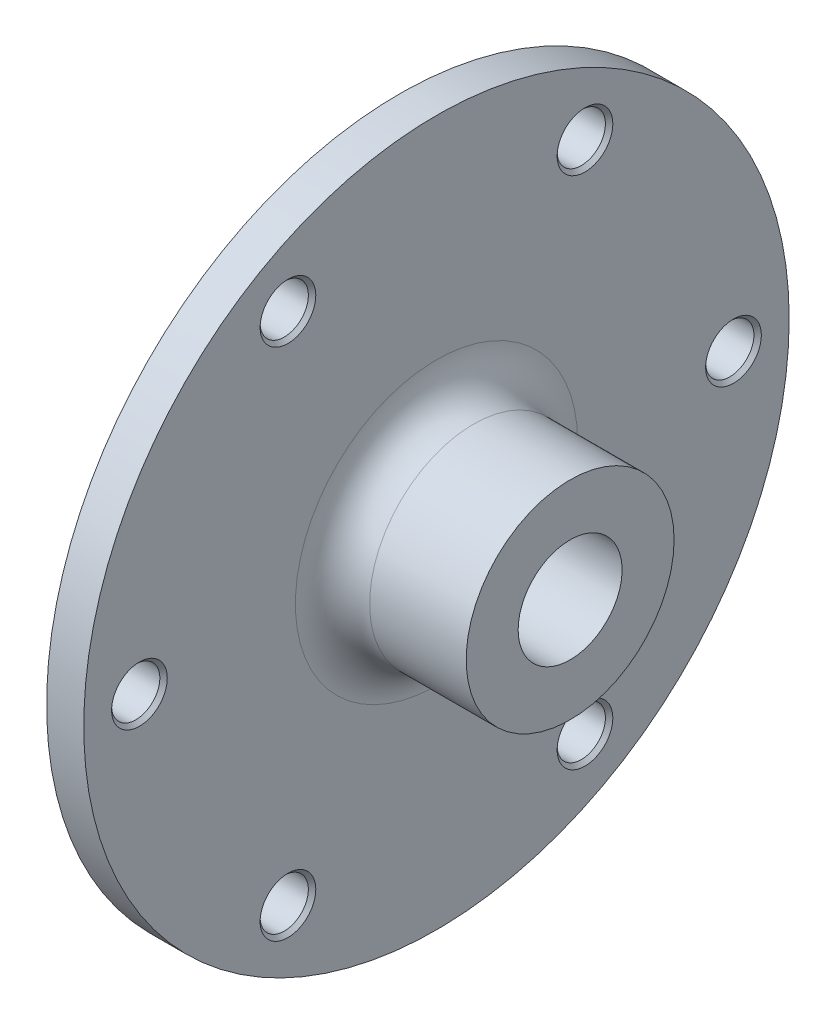
ISO-10303-21;
HEADER;
FILE_DESCRIPTION(('STEP AP214'),'2;1');
FILE_NAME('part.step','',(''),(''),'','','');
FILE_SCHEMA(('AUTOMOTIVE_DESIGN { 1 0 10303 214 1 1 1 1 }'));
ENDSEC;
DATA;
#1=APPLICATION_CONTEXT('core data for automotive mechanical design processes');
#2=APPLICATION_PROTOCOL_DEFINITION('international standard','automotive_design',2000,#1);
#3=PRODUCT_CONTEXT('',#1,'mechanical');
#4=PRODUCT('Part','Part','',(#3));
#5=PRODUCT_RELATED_PRODUCT_CATEGORY('part','',(#4));
#6=PRODUCT_DEFINITION_FORMATION('','',#4);
#7=PRODUCT_DEFINITION_CONTEXT('part definition',#1,'design');
#8=PRODUCT_DEFINITION('design','',#6,#7);
#9=PRODUCT_DEFINITION_SHAPE('','',#8);
#10=(LENGTH_UNIT() NAMED_UNIT(*) SI_UNIT(.MILLI.,.METRE.));
#11=(NAMED_UNIT(*) PLANE_ANGLE_UNIT() SI_UNIT($,.RADIAN.));
#12=(NAMED_UNIT(*) SI_UNIT($,.STERADIAN.) SOLID_ANGLE_UNIT());
#13=UNCERTAINTY_MEASURE_WITH_UNIT(LENGTH_MEASURE(1.E-05),#10,'distance_accuracy_value','');
#14=(GEOMETRIC_REPRESENTATION_CONTEXT(3) GLOBAL_UNCERTAINTY_ASSIGNED_CONTEXT((#13)) GLOBAL_UNIT_ASSIGNED_CONTEXT((#10,
#11,#12)) REPRESENTATION_CONTEXT('',''));
#15=CARTESIAN_POINT('',(0.,0.,0.));
#16=DIRECTION('',(0.,0.,1.));
#17=DIRECTION('',(1.,0.,0.));
#18=AXIS2_PLACEMENT_3D('',#15,#16,#17);
#19=CARTESIAN_POINT('',(0.,14.,0.));
#20=DIRECTION('',(1.,0.,0.));
#21=DIRECTION('',(0.,0.,-1.));
#22=AXIS2_PLACEMENT_3D('',#19,#20,#21);
#23=PLANE('',#22);
#24=CARTESIAN_POINT('',(0.,0.,0.));
#25=DIRECTION('',(-1.,0.,0.));
#26=DIRECTION('',(0.,0.,1.));
#27=AXIS2_PLACEMENT_3D('',#24,#25,#26);
#28=CIRCLE('',#27,6.99999999999999);
#29=CARTESIAN_POINT('',(0.,0.,6.99999999999999));
#30=VERTEX_POINT('',#29);
#31=EDGE_CURVE('E128',#30,#30,#28,.T.);
#32=ORIENTED_EDGE('',*,*,#31,.T.);
#33=EDGE_LOOP('',(#32));
#34=FACE_BOUND('',#33,.T.);
#35=CARTESIAN_POINT('',(0.,0.,0.));
#36=DIRECTION('',(1.,0.,0.));
#37=DIRECTION('',(0.,0.,-1.));
#38=AXIS2_PLACEMENT_3D('',#35,#36,#37);
#39=CIRCLE('',#38,14.);
#40=CARTESIAN_POINT('',(0.,0.,-14.));
#41=VERTEX_POINT('',#40);
#42=EDGE_CURVE('E132',#41,#41,#39,.T.);
#43=ORIENTED_EDGE('',*,*,#42,.T.);
#44=EDGE_LOOP('',(#43));
#45=FACE_BOUND('',#44,.T.);
#46=ADVANCED_FACE('F37',(#34,#45),#23,.T.);
#47=CARTESIAN_POINT('',(-28.,0.,0.));
#48=DIRECTION('',(-1.,0.,0.));
#49=DIRECTION('',(0.,0.,1.));
#50=AXIS2_PLACEMENT_3D('',#47,#48,#49);
#51=PLANE('',#50);
#52=CARTESIAN_POINT('',(-28.,0.,0.));
#53=DIRECTION('',(-1.,0.,0.));
#54=DIRECTION('',(0.,0.,1.));
#55=AXIS2_PLACEMENT_3D('',#52,#53,#54);
#56=CIRCLE('',#55,13.);
#57=CARTESIAN_POINT('',(-28.,0.,13.));
#58=VERTEX_POINT('',#57);
#59=EDGE_CURVE('E60',#58,#58,#56,.T.);
#60=ORIENTED_EDGE('',*,*,#59,.F.);
#61=EDGE_LOOP('',(#60));
#62=FACE_BOUND('',#61,.T.);
#63=CARTESIAN_POINT('',(-28.,0.,0.));
#64=DIRECTION('',(1.,0.,0.));
#65=DIRECTION('',(0.,0.,-1.));
#66=AXIS2_PLACEMENT_3D('',#63,#64,#65);
#67=CIRCLE('',#66,35.);
#68=CARTESIAN_POINT('',(-28.,0.,-35.));
#69=VERTEX_POINT('',#68);
#70=EDGE_CURVE('E52',#69,#69,#67,.T.);
#71=ORIENTED_EDGE('',*,*,#70,.F.);
#72=EDGE_LOOP('',(#71));
#73=FACE_BOUND('',#72,.T.);
#74=ADVANCED_FACE('F154',(#62,#73),#51,.T.);
#75=CARTESIAN_POINT('',(0.,0.,0.));
#76=DIRECTION('',(1.,0.,0.));
#77=DIRECTION('',(0.,0.,-1.));
#78=AXIS2_PLACEMENT_3D('',#75,#76,#77);
#79=CYLINDRICAL_SURFACE('',#78,35.);
#80=ORIENTED_EDGE('',*,*,#70,.T.);
#81=EDGE_LOOP('',(#80));
#82=FACE_BOUND('',#81,.T.);
#83=CARTESIAN_POINT('',(-23.,0.,0.));
#84=DIRECTION('',(1.,0.,0.));
#85=DIRECTION('',(0.,0.,-1.));
#86=AXIS2_PLACEMENT_3D('',#83,#84,#85);
#87=CIRCLE('',#86,35.);
#88=CARTESIAN_POINT('',(-23.,0.,-35.));
#89=VERTEX_POINT('',#88);
#90=EDGE_CURVE('E144',#89,#89,#87,.T.);
#91=ORIENTED_EDGE('',*,*,#90,.F.);
#92=EDGE_LOOP('',(#91));
#93=FACE_BOUND('',#92,.T.);
#94=ADVANCED_FACE('F151',(#82,#93),#79,.T.);
#95=CARTESIAN_POINT('',(-23.,35.,0.));
#96=DIRECTION('',(-1.,0.,0.));
#97=DIRECTION('',(0.,0.,1.));
#98=AXIS2_PLACEMENT_3D('',#95,#96,#97);
#99=PLANE('',#98);
#100=CARTESIAN_POINT('',(-23.,34.6410161513773,20.0000000000004));
#101=DIRECTION('',(-1.,0.,0.));
#102=DIRECTION('',(0.,0.,1.));
#103=AXIS2_PLACEMENT_3D('',#100,#101,#102);
#104=CIRCLE('',#103,3.25);
#105=CARTESIAN_POINT('',(-23.,34.6410161513773,23.2500000000004));
#106=VERTEX_POINT('',#105);
#107=EDGE_CURVE('E41',#106,#106,#104,.T.);
#108=ORIENTED_EDGE('',*,*,#107,.F.);
#109=EDGE_LOOP('',(#108));
#110=FACE_BOUND('',#109,.T.);
#111=CARTESIAN_POINT('',(-23.,34.6410161513777,-19.9999999999997));
#112=DIRECTION('',(-1.,0.,0.));
#113=DIRECTION('',(0.,0.,1.));
#114=AXIS2_PLACEMENT_3D('',#111,#112,#113);
#115=CIRCLE('',#114,3.25);
#116=CARTESIAN_POINT('',(-23.,34.6410161513777,-16.7499999999997));
#117=VERTEX_POINT('',#116);
#118=EDGE_CURVE('E79',#117,#117,#115,.T.);
#119=ORIENTED_EDGE('',*,*,#118,.F.);
#120=EDGE_LOOP('',(#119));
#121=FACE_BOUND('',#120,.T.);
#122=CARTESIAN_POINT('',(-23.,0.,-40.));
#123=DIRECTION('',(-1.,0.,0.));
#124=DIRECTION('',(0.,0.,1.));
#125=AXIS2_PLACEMENT_3D('',#122,#123,#124);
#126=CIRCLE('',#125,3.25);
#127=CARTESIAN_POINT('',(-23.,0.,-36.75));
#128=VERTEX_POINT('',#127);
#129=EDGE_CURVE('E74',#128,#128,#126,.T.);
#130=ORIENTED_EDGE('',*,*,#129,.F.);
#131=EDGE_LOOP('',(#130));
#132=FACE_BOUND('',#131,.T.);
#133=CARTESIAN_POINT('',(-23.,-34.6410161513775,-20.0000000000002));
#134=DIRECTION('',(-1.,0.,0.));
#135=DIRECTION('',(0.,0.,1.));
#136=AXIS2_PLACEMENT_3D('',#133,#134,#135);
#137=CIRCLE('',#136,3.25);
#138=CARTESIAN_POINT('',(-23.,-34.6410161513775,-16.7500000000002));
#139=VERTEX_POINT('',#138);
#140=EDGE_CURVE('E68',#139,#139,#137,.T.);
#141=ORIENTED_EDGE('',*,*,#140,.F.);
#142=EDGE_LOOP('',(#141));
#143=FACE_BOUND('',#142,.T.);
#144=CARTESIAN_POINT('',(-23.,-34.6410161513776,19.9999999999999));
#145=DIRECTION('',(-1.,0.,0.));
#146=DIRECTION('',(0.,0.,1.));
#147=AXIS2_PLACEMENT_3D('',#144,#145,#146);
#148=CIRCLE('',#147,3.25);
#149=CARTESIAN_POINT('',(-23.,-34.6410161513776,23.2499999999999));
#150=VERTEX_POINT('',#149);
#151=EDGE_CURVE('E62',#150,#150,#148,.T.);
#152=ORIENTED_EDGE('',*,*,#151,.F.);
#153=EDGE_LOOP('',(#152));
#154=FACE_BOUND('',#153,.T.);
#155=CARTESIAN_POINT('',(-23.,0.,40.));
#156=DIRECTION('',(-1.,0.,0.));
#157=DIRECTION('',(0.,0.,1.));
#158=AXIS2_PLACEMENT_3D('',#155,#156,#157);
#159=CIRCLE('',#158,3.25);
#160=CARTESIAN_POINT('',(-23.,0.,43.25));
#161=VERTEX_POINT('',#160);
#162=EDGE_CURVE('E56',#161,#161,#159,.T.);
#163=ORIENTED_EDGE('',*,*,#162,.F.);
#164=EDGE_LOOP('',(#163));
#165=FACE_BOUND('',#164,.T.);
#166=ORIENTED_EDGE('',*,*,#90,.T.);
#167=EDGE_LOOP('',(#166));
#168=FACE_BOUND('',#167,.T.);
#169=CARTESIAN_POINT('',(-23.,0.,0.));
#170=DIRECTION('',(1.,0.,0.));
#171=DIRECTION('',(0.,0.,-1.));
#172=AXIS2_PLACEMENT_3D('',#169,#170,#171);
#173=CIRCLE('',#172,47.5);
#174=CARTESIAN_POINT('',(-23.,0.,-47.5));
#175=VERTEX_POINT('',#174);
#176=EDGE_CURVE('E140',#175,#175,#173,.T.);
#177=ORIENTED_EDGE('',*,*,#176,.F.);
#178=EDGE_LOOP('',(#177));
#179=FACE_BOUND('',#178,.T.);
#180=ADVANCED_FACE('F162',(#110,#121,#132,#143,#154,#165,#168,#179),#99,.T.);
#181=CARTESIAN_POINT('',(0.,0.,0.));
#182=DIRECTION('',(1.,0.,0.));
#183=DIRECTION('',(0.,0.,-1.));
#184=AXIS2_PLACEMENT_3D('',#181,#182,#183);
#185=CYLINDRICAL_SURFACE('',#184,47.5);
#186=ORIENTED_EDGE('',*,*,#176,.T.);
#187=EDGE_LOOP('',(#186));
#188=FACE_BOUND('',#187,.T.);
#189=CARTESIAN_POINT('',(-18.,0.,0.));
#190=DIRECTION('',(1.,0.,0.));
#191=DIRECTION('',(0.,0.,-1.));
#192=AXIS2_PLACEMENT_3D('',#189,#190,#191);
#193=CIRCLE('',#192,47.5);
#194=CARTESIAN_POINT('',(-18.,0.,-47.5));
#195=VERTEX_POINT('',#194);
#196=EDGE_CURVE('E136',#195,#195,#193,.T.);
#197=ORIENTED_EDGE('',*,*,#196,.F.);
#198=EDGE_LOOP('',(#197));
#199=FACE_BOUND('',#198,.T.);
#200=ADVANCED_FACE('F169',(#188,#199),#185,.T.);
#201=CARTESIAN_POINT('',(-18.,47.5,0.));
#202=DIRECTION('',(1.,0.,0.));
#203=DIRECTION('',(0.,0.,-1.));
#204=AXIS2_PLACEMENT_3D('',#201,#202,#203);
#205=PLANE('',#204);
#206=CARTESIAN_POINT('',(-18.,34.6410161513773,20.0000000000004));
#207=DIRECTION('',(1.,0.,0.));
#208=DIRECTION('',(0.,0.,-1.));
#209=AXIS2_PLACEMENT_3D('',#206,#207,#208);
#210=CIRCLE('',#209,3.75);
#211=CARTESIAN_POINT('',(-18.,34.6410161513773,16.2500000000004));
#212=VERTEX_POINT('',#211);
#213=EDGE_CURVE('E244',#212,#212,#210,.T.);
#214=ORIENTED_EDGE('',*,*,#213,.F.);
#215=EDGE_LOOP('',(#214));
#216=FACE_BOUND('',#215,.T.);
#217=CARTESIAN_POINT('',(-18.,34.6410161513777,-19.9999999999997));
#218=DIRECTION('',(1.,0.,0.));
#219=DIRECTION('',(0.,0.,-1.));
#220=AXIS2_PLACEMENT_3D('',#217,#218,#219);
#221=CIRCLE('',#220,3.75);
#222=CARTESIAN_POINT('',(-18.,34.6410161513777,-23.7499999999997));
#223=VERTEX_POINT('',#222);
#224=EDGE_CURVE('E91',#223,#223,#221,.T.);
#225=ORIENTED_EDGE('',*,*,#224,.F.);
#226=EDGE_LOOP('',(#225));
#227=FACE_BOUND('',#226,.T.);
#228=CARTESIAN_POINT('',(-18.,0.,-40.));
#229=DIRECTION('',(1.,0.,0.));
#230=DIRECTION('',(0.,0.,-1.));
#231=AXIS2_PLACEMENT_3D('',#228,#229,#230);
#232=CIRCLE('',#231,3.75);
#233=CARTESIAN_POINT('',(-18.,0.,-43.75));
#234=VERTEX_POINT('',#233);
#235=EDGE_CURVE('E82',#234,#234,#232,.T.);
#236=ORIENTED_EDGE('',*,*,#235,.F.);
#237=EDGE_LOOP('',(#236));
#238=FACE_BOUND('',#237,.T.);
#239=CARTESIAN_POINT('',(-18.,-34.6410161513775,-20.0000000000002));
#240=DIRECTION('',(1.,0.,0.));
#241=DIRECTION('',(0.,0.,-1.));
#242=AXIS2_PLACEMENT_3D('',#239,#240,#241);
#243=CIRCLE('',#242,3.75);
#244=CARTESIAN_POINT('',(-18.,-34.6410161513775,-23.7500000000002));
#245=VERTEX_POINT('',#244);
#246=EDGE_CURVE('E77',#245,#245,#243,.T.);
#247=ORIENTED_EDGE('',*,*,#246,.F.);
#248=EDGE_LOOP('',(#247));
#249=FACE_BOUND('',#248,.T.);
#250=CARTESIAN_POINT('',(-18.,-34.6410161513776,19.9999999999999));
#251=DIRECTION('',(1.,0.,0.));
#252=DIRECTION('',(0.,0.,-1.));
#253=AXIS2_PLACEMENT_3D('',#250,#251,#252);
#254=CIRCLE('',#253,3.75);
#255=CARTESIAN_POINT('',(-18.,-34.6410161513776,16.2499999999999));
#256=VERTEX_POINT('',#255);
#257=EDGE_CURVE('E72',#256,#256,#254,.T.);
#258=ORIENTED_EDGE('',*,*,#257,.F.);
#259=EDGE_LOOP('',(#258));
#260=FACE_BOUND('',#259,.T.);
#261=CARTESIAN_POINT('',(-18.,0.,40.));
#262=DIRECTION('',(1.,0.,0.));
#263=DIRECTION('',(0.,0.,-1.));
#264=AXIS2_PLACEMENT_3D('',#261,#262,#263);
#265=CIRCLE('',#264,3.75);
#266=CARTESIAN_POINT('',(-18.,0.,36.25));
#267=VERTEX_POINT('',#266);
#268=EDGE_CURVE('E66',#267,#267,#265,.T.);
#269=ORIENTED_EDGE('',*,*,#268,.F.);
#270=EDGE_LOOP('',(#269));
#271=FACE_BOUND('',#270,.T.);
#272=CARTESIAN_POINT('',(-18.,0.,0.));
#273=DIRECTION('',(1.,0.,0.));
#274=DIRECTION('',(0.,0.,-1.));
#275=AXIS2_PLACEMENT_3D('',#272,#273,#274);
#276=CIRCLE('',#275,19.);
#277=CARTESIAN_POINT('',(-18.,0.,-19.));
#278=VERTEX_POINT('',#277);
#279=EDGE_CURVE('E10',#278,#278,#276,.F.);
#280=ORIENTED_EDGE('',*,*,#279,.T.);
#281=EDGE_LOOP('',(#280));
#282=FACE_BOUND('',#281,.T.);
#283=ORIENTED_EDGE('',*,*,#196,.T.);
#284=EDGE_LOOP('',(#283));
#285=FACE_BOUND('',#284,.T.);
#286=ADVANCED_FACE('F173',(#216,#227,#238,#249,#260,#271,#282,#285),#205,.T.);
#287=CARTESIAN_POINT('',(0.,0.,0.));
#288=DIRECTION('',(1.,0.,0.));
#289=DIRECTION('',(0.,0.,-1.));
#290=AXIS2_PLACEMENT_3D('',#287,#288,#289);
#291=CYLINDRICAL_SURFACE('',#290,14.);
#292=CARTESIAN_POINT('',(-13.,0.,0.));
#293=DIRECTION('',(1.,0.,0.));
#294=DIRECTION('',(0.,0.,-1.));
#295=AXIS2_PLACEMENT_3D('',#292,#293,#294);
#296=CIRCLE('',#295,14.);
#297=CARTESIAN_POINT('',(-13.,0.,-14.));
#298=VERTEX_POINT('',#297);
#299=EDGE_CURVE('E46',#298,#298,#296,.T.);
#300=ORIENTED_EDGE('',*,*,#299,.T.);
#301=EDGE_LOOP('',(#300));
#302=FACE_BOUND('',#301,.T.);
#303=ORIENTED_EDGE('',*,*,#42,.F.);
#304=EDGE_LOOP('',(#303));
#305=FACE_BOUND('',#304,.T.);
#306=ADVANCED_FACE('F177',(#302,#305),#291,.T.);
#307=CARTESIAN_POINT('',(-13.,0.,0.));
#308=DIRECTION('',(1.,0.,0.));
#309=DIRECTION('',(0.,0.,-1.));
#310=AXIS2_PLACEMENT_3D('',#307,#308,#309);
#311=TOROIDAL_SURFACE('',#310,19.,5.);
#312=ORIENTED_EDGE('',*,*,#279,.F.);
#313=EDGE_LOOP('',(#312));
#314=FACE_BOUND('',#313,.T.);
#315=ORIENTED_EDGE('',*,*,#299,.F.);
#316=EDGE_LOOP('',(#315));
#317=FACE_BOUND('',#316,.T.);
#318=ADVANCED_FACE('F39',(#314,#317),#311,.F.);
#319=CARTESIAN_POINT('',(-28.,0.,0.));
#320=DIRECTION('',(-1.,0.,0.));
#321=DIRECTION('',(0.,0.,1.));
#322=AXIS2_PLACEMENT_3D('',#319,#320,#321);
#323=CYLINDRICAL_SURFACE('',#322,6.99999999999999);
#324=ORIENTED_EDGE('',*,*,#31,.F.);
#325=EDGE_LOOP('',(#324));
#326=FACE_BOUND('',#325,.T.);
#327=CARTESIAN_POINT('',(-22.,0.,0.));
#328=DIRECTION('',(-1.,0.,0.));
#329=DIRECTION('',(0.,0.,1.));
#330=AXIS2_PLACEMENT_3D('',#327,#328,#329);
#331=CIRCLE('',#330,7.);
#332=CARTESIAN_POINT('',(-22.,0.,7.));
#333=VERTEX_POINT('',#332);
#334=EDGE_CURVE('E124',#333,#333,#331,.T.);
#335=ORIENTED_EDGE('',*,*,#334,.T.);
#336=EDGE_LOOP('',(#335));
#337=FACE_BOUND('',#336,.T.);
#338=ADVANCED_FACE('F182',(#326,#337),#323,.F.);
#339=CARTESIAN_POINT('',(-28.,0.,0.));
#340=DIRECTION('',(-1.,0.,0.));
#341=DIRECTION('',(0.,0.,1.));
#342=AXIS2_PLACEMENT_3D('',#339,#340,#341);
#343=CONICAL_SURFACE('',#342,13.,0.785398163397449);
#344=ORIENTED_EDGE('',*,*,#334,.F.);
#345=EDGE_LOOP('',(#344));
#346=FACE_BOUND('',#345,.T.);
#347=ORIENTED_EDGE('',*,*,#59,.T.);
#348=EDGE_LOOP('',(#347));
#349=FACE_BOUND('',#348,.T.);
#350=ADVANCED_FACE('F185',(#346,#349),#343,.F.);
#351=CARTESIAN_POINT('',(-18.,0.,40.));
#352=DIRECTION('',(1.,0.,0.));
#353=DIRECTION('',(0.,0.,-1.));
#354=AXIS2_PLACEMENT_3D('',#351,#352,#353);
#355=CYLINDRICAL_SURFACE('',#354,3.25);
#356=ORIENTED_EDGE('',*,*,#162,.T.);
#357=EDGE_LOOP('',(#356));
#358=FACE_BOUND('',#357,.T.);
#359=CARTESIAN_POINT('',(-18.5,0.,40.));
#360=DIRECTION('',(1.,0.,0.));
#361=DIRECTION('',(0.,0.,-1.));
#362=AXIS2_PLACEMENT_3D('',#359,#360,#361);
#363=CIRCLE('',#362,3.25);
#364=CARTESIAN_POINT('',(-18.5,0.,36.75));
#365=VERTEX_POINT('',#364);
#366=EDGE_CURVE('E61',#365,#365,#363,.T.);
#367=ORIENTED_EDGE('',*,*,#366,.T.);
#368=EDGE_LOOP('',(#367));
#369=FACE_BOUND('',#368,.T.);
#370=ADVANCED_FACE('F189',(#358,#369),#355,.F.);
#371=CARTESIAN_POINT('',(-18.,0.,40.));
#372=DIRECTION('',(1.,0.,0.));
#373=DIRECTION('',(0.,0.,-1.));
#374=AXIS2_PLACEMENT_3D('',#371,#372,#373);
#375=CONICAL_SURFACE('',#374,3.75,0.785398163397447);
#376=ORIENTED_EDGE('',*,*,#366,.F.);
#377=EDGE_LOOP('',(#376));
#378=FACE_BOUND('',#377,.T.);
#379=ORIENTED_EDGE('',*,*,#268,.T.);
#380=EDGE_LOOP('',(#379));
#381=FACE_BOUND('',#380,.T.);
#382=ADVANCED_FACE('F193',(#378,#381),#375,.F.);
#383=CARTESIAN_POINT('',(-18.,-34.6410161513776,19.9999999999999));
#384=DIRECTION('',(1.,0.,0.));
#385=DIRECTION('',(0.,0.,-1.));
#386=AXIS2_PLACEMENT_3D('',#383,#384,#385);
#387=CYLINDRICAL_SURFACE('',#386,3.25);
#388=ORIENTED_EDGE('',*,*,#151,.T.);
#389=EDGE_LOOP('',(#388));
#390=FACE_BOUND('',#389,.T.);
#391=CARTESIAN_POINT('',(-18.5,-34.6410161513776,19.9999999999999));
#392=DIRECTION('',(1.,0.,0.));
#393=DIRECTION('',(0.,0.,-1.));
#394=AXIS2_PLACEMENT_3D('',#391,#392,#393);
#395=CIRCLE('',#394,3.25);
#396=CARTESIAN_POINT('',(-18.5,-34.6410161513776,16.7499999999999));
#397=VERTEX_POINT('',#396);
#398=EDGE_CURVE('E67',#397,#397,#395,.T.);
#399=ORIENTED_EDGE('',*,*,#398,.T.);
#400=EDGE_LOOP('',(#399));
#401=FACE_BOUND('',#400,.T.);
#402=ADVANCED_FACE('F197',(#390,#401),#387,.F.);
#403=CARTESIAN_POINT('',(-18.,-34.6410161513776,19.9999999999999));
#404=DIRECTION('',(1.,0.,0.));
#405=DIRECTION('',(0.,0.,-1.));
#406=AXIS2_PLACEMENT_3D('',#403,#404,#405);
#407=CONICAL_SURFACE('',#406,3.75,0.785398163397448);
#408=ORIENTED_EDGE('',*,*,#398,.F.);
#409=EDGE_LOOP('',(#408));
#410=FACE_BOUND('',#409,.T.);
#411=ORIENTED_EDGE('',*,*,#257,.T.);
#412=EDGE_LOOP('',(#411));
#413=FACE_BOUND('',#412,.T.);
#414=ADVANCED_FACE('F201',(#410,#413),#407,.F.);
#415=CARTESIAN_POINT('',(-18.,-34.6410161513775,-20.0000000000002));
#416=DIRECTION('',(1.,0.,0.));
#417=DIRECTION('',(0.,0.,-1.));
#418=AXIS2_PLACEMENT_3D('',#415,#416,#417);
#419=CYLINDRICAL_SURFACE('',#418,3.25);
#420=ORIENTED_EDGE('',*,*,#140,.T.);
#421=EDGE_LOOP('',(#420));
#422=FACE_BOUND('',#421,.T.);
#423=CARTESIAN_POINT('',(-18.5,-34.6410161513775,-20.0000000000002));
#424=DIRECTION('',(1.,0.,0.));
#425=DIRECTION('',(0.,0.,-1.));
#426=AXIS2_PLACEMENT_3D('',#423,#424,#425);
#427=CIRCLE('',#426,3.25);
#428=CARTESIAN_POINT('',(-18.5,-34.6410161513775,-23.2500000000002));
#429=VERTEX_POINT('',#428);
#430=EDGE_CURVE('E73',#429,#429,#427,.T.);
#431=ORIENTED_EDGE('',*,*,#430,.T.);
#432=EDGE_LOOP('',(#431));
#433=FACE_BOUND('',#432,.T.);
#434=ADVANCED_FACE('F205',(#422,#433),#419,.F.);
#435=CARTESIAN_POINT('',(-18.,-34.6410161513775,-20.0000000000002));
#436=DIRECTION('',(1.,0.,0.));
#437=DIRECTION('',(0.,0.,-1.));
#438=AXIS2_PLACEMENT_3D('',#435,#436,#437);
#439=CONICAL_SURFACE('',#438,3.75,0.785398163397448);
#440=ORIENTED_EDGE('',*,*,#430,.F.);
#441=EDGE_LOOP('',(#440));
#442=FACE_BOUND('',#441,.T.);
#443=ORIENTED_EDGE('',*,*,#246,.T.);
#444=EDGE_LOOP('',(#443));
#445=FACE_BOUND('',#444,.T.);
#446=ADVANCED_FACE('F209',(#442,#445),#439,.F.);
#447=CARTESIAN_POINT('',(-18.,0.,-40.));
#448=DIRECTION('',(1.,0.,0.));
#449=DIRECTION('',(0.,0.,-1.));
#450=AXIS2_PLACEMENT_3D('',#447,#448,#449);
#451=CYLINDRICAL_SURFACE('',#450,3.25);
#452=ORIENTED_EDGE('',*,*,#129,.T.);
#453=EDGE_LOOP('',(#452));
#454=FACE_BOUND('',#453,.T.);
#455=CARTESIAN_POINT('',(-18.5,0.,-40.));
#456=DIRECTION('',(1.,0.,0.));
#457=DIRECTION('',(0.,0.,-1.));
#458=AXIS2_PLACEMENT_3D('',#455,#456,#457);
#459=CIRCLE('',#458,3.25);
#460=CARTESIAN_POINT('',(-18.5,0.,-43.25));
#461=VERTEX_POINT('',#460);
#462=EDGE_CURVE('E78',#461,#461,#459,.T.);
#463=ORIENTED_EDGE('',*,*,#462,.T.);
#464=EDGE_LOOP('',(#463));
#465=FACE_BOUND('',#464,.T.);
#466=ADVANCED_FACE('F213',(#454,#465),#451,.F.);
#467=CARTESIAN_POINT('',(-18.,0.,-40.));
#468=DIRECTION('',(1.,0.,0.));
#469=DIRECTION('',(0.,0.,-1.));
#470=AXIS2_PLACEMENT_3D('',#467,#468,#469);
#471=CONICAL_SURFACE('',#470,3.75,0.785398163397447);
#472=ORIENTED_EDGE('',*,*,#462,.F.);
#473=EDGE_LOOP('',(#472));
#474=FACE_BOUND('',#473,.T.);
#475=ORIENTED_EDGE('',*,*,#235,.T.);
#476=EDGE_LOOP('',(#475));
#477=FACE_BOUND('',#476,.T.);
#478=ADVANCED_FACE('F217',(#474,#477),#471,.F.);
#479=CARTESIAN_POINT('',(-18.,34.6410161513777,-19.9999999999997));
#480=DIRECTION('',(1.,0.,0.));
#481=DIRECTION('',(0.,0.,-1.));
#482=AXIS2_PLACEMENT_3D('',#479,#480,#481);
#483=CYLINDRICAL_SURFACE('',#482,3.25);
#484=ORIENTED_EDGE('',*,*,#118,.T.);
#485=EDGE_LOOP('',(#484));
#486=FACE_BOUND('',#485,.T.);
#487=CARTESIAN_POINT('',(-18.5,34.6410161513777,-19.9999999999997));
#488=DIRECTION('',(1.,0.,0.));
#489=DIRECTION('',(0.,0.,-1.));
#490=AXIS2_PLACEMENT_3D('',#487,#488,#489);
#491=CIRCLE('',#490,3.25);
#492=CARTESIAN_POINT('',(-18.5,34.6410161513777,-23.2499999999997));
#493=VERTEX_POINT('',#492);
#494=EDGE_CURVE('E83',#493,#493,#491,.T.);
#495=ORIENTED_EDGE('',*,*,#494,.T.);
#496=EDGE_LOOP('',(#495));
#497=FACE_BOUND('',#496,.T.);
#498=ADVANCED_FACE('F221',(#486,#497),#483,.F.);
#499=CARTESIAN_POINT('',(-18.,34.6410161513777,-19.9999999999997));
#500=DIRECTION('',(1.,0.,0.));
#501=DIRECTION('',(0.,0.,-1.));
#502=AXIS2_PLACEMENT_3D('',#499,#500,#501);
#503=CONICAL_SURFACE('',#502,3.75,0.785398163397445);
#504=ORIENTED_EDGE('',*,*,#494,.F.);
#505=EDGE_LOOP('',(#504));
#506=FACE_BOUND('',#505,.T.);
#507=ORIENTED_EDGE('',*,*,#224,.T.);
#508=EDGE_LOOP('',(#507));
#509=FACE_BOUND('',#508,.T.);
#510=ADVANCED_FACE('F225',(#506,#509),#503,.F.);
#511=CARTESIAN_POINT('',(-18.,34.6410161513773,20.0000000000004));
#512=DIRECTION('',(1.,0.,0.));
#513=DIRECTION('',(0.,0.,-1.));
#514=AXIS2_PLACEMENT_3D('',#511,#512,#513);
#515=CYLINDRICAL_SURFACE('',#514,3.25);
#516=ORIENTED_EDGE('',*,*,#107,.T.);
#517=EDGE_LOOP('',(#516));
#518=FACE_BOUND('',#517,.T.);
#519=CARTESIAN_POINT('',(-18.5,34.6410161513773,20.0000000000004));
#520=DIRECTION('',(1.,0.,0.));
#521=DIRECTION('',(0.,0.,-1.));
#522=AXIS2_PLACEMENT_3D('',#519,#520,#521);
#523=CIRCLE('',#522,3.25);
#524=CARTESIAN_POINT('',(-18.5,34.6410161513773,16.7500000000004));
#525=VERTEX_POINT('',#524);
#526=EDGE_CURVE('E241',#525,#525,#523,.T.);
#527=ORIENTED_EDGE('',*,*,#526,.T.);
#528=EDGE_LOOP('',(#527));
#529=FACE_BOUND('',#528,.T.);
#530=ADVANCED_FACE('F228',(#518,#529),#515,.F.);
#531=CARTESIAN_POINT('',(-18.,34.6410161513773,20.0000000000004));
#532=DIRECTION('',(1.,0.,0.));
#533=DIRECTION('',(0.,0.,-1.));
#534=AXIS2_PLACEMENT_3D('',#531,#532,#533);
#535=CONICAL_SURFACE('',#534,3.75,0.785398163397445);
#536=ORIENTED_EDGE('',*,*,#526,.F.);
#537=EDGE_LOOP('',(#536));
#538=FACE_BOUND('',#537,.T.);
#539=ORIENTED_EDGE('',*,*,#213,.T.);
#540=EDGE_LOOP('',(#539));
#541=FACE_BOUND('',#540,.T.);
#542=ADVANCED_FACE('F232',(#538,#541),#535,.F.);
#543=CLOSED_SHELL('',(#46,#74,#94,#180,#200,#286,#306,#318,#338,#350,#370,#382,#402,#414,#434,
#446,#466,#478,#498,#510,#530,#542));
#544=MANIFOLD_SOLID_BREP('B2',#543);
#545=ADVANCED_BREP_SHAPE_REPRESENTATION('',(#18,#544),#14);
#546=SHAPE_DEFINITION_REPRESENTATION(#9,#545);
ENDSEC;
END-ISO-10303-21;
